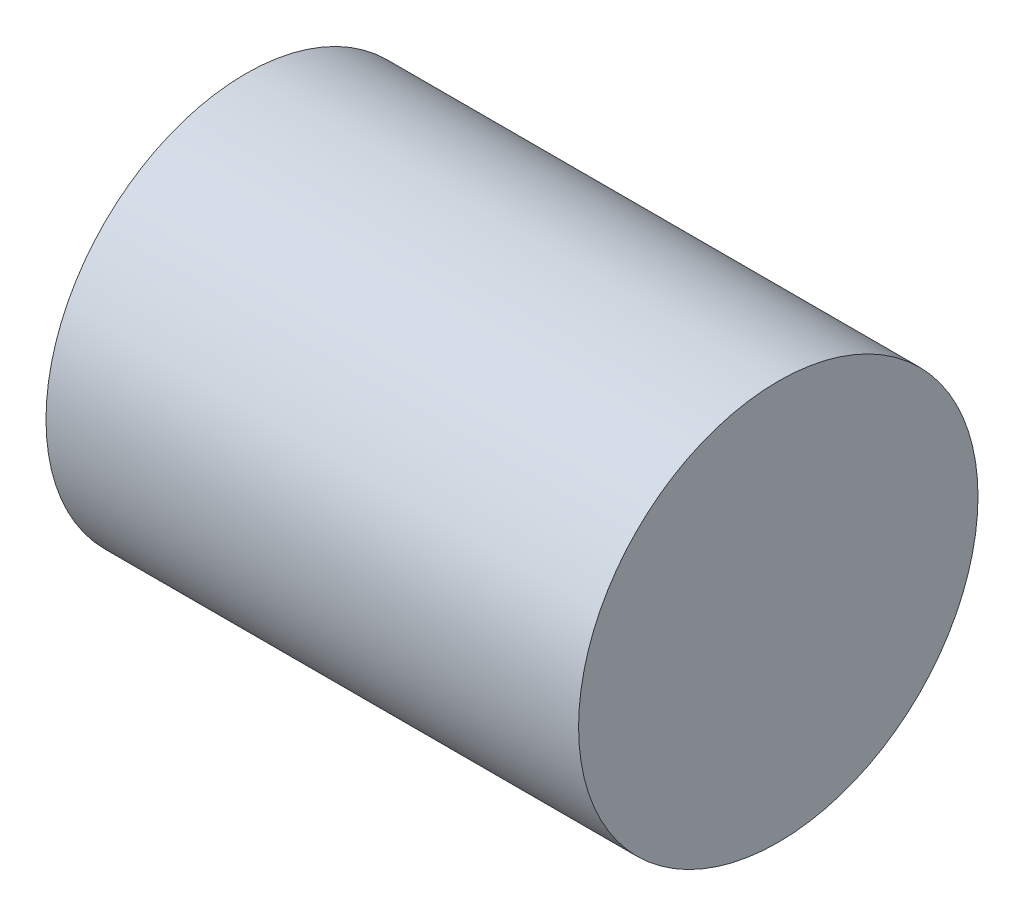
ISO-10303-21;
HEADER;
FILE_DESCRIPTION(('STEP AP214'),'2;1');
FILE_NAME('part.step','',(''),(''),'','','');
FILE_SCHEMA(('AUTOMOTIVE_DESIGN { 1 0 10303 214 1 1 1 1 }'));
ENDSEC;
DATA;
#1=APPLICATION_CONTEXT('core data for automotive mechanical design processes');
#2=APPLICATION_PROTOCOL_DEFINITION('international standard','automotive_design',2000,#1);
#3=PRODUCT_CONTEXT('',#1,'mechanical');
#4=PRODUCT('Part','Part','',(#3));
#5=PRODUCT_RELATED_PRODUCT_CATEGORY('part','',(#4));
#6=PRODUCT_DEFINITION_FORMATION('','',#4);
#7=PRODUCT_DEFINITION_CONTEXT('part definition',#1,'design');
#8=PRODUCT_DEFINITION('design','',#6,#7);
#9=PRODUCT_DEFINITION_SHAPE('','',#8);
#10=(LENGTH_UNIT() NAMED_UNIT(*) SI_UNIT(.MILLI.,.METRE.));
#11=(NAMED_UNIT(*) PLANE_ANGLE_UNIT() SI_UNIT($,.RADIAN.));
#12=(NAMED_UNIT(*) SI_UNIT($,.STERADIAN.) SOLID_ANGLE_UNIT());
#13=UNCERTAINTY_MEASURE_WITH_UNIT(LENGTH_MEASURE(1.E-05),#10,'distance_accuracy_value','');
#14=(GEOMETRIC_REPRESENTATION_CONTEXT(3) GLOBAL_UNCERTAINTY_ASSIGNED_CONTEXT((#13)) GLOBAL_UNIT_ASSIGNED_CONTEXT((#10,
#11,#12)) REPRESENTATION_CONTEXT('',''));
#15=CARTESIAN_POINT('',(0.,0.,0.));
#16=DIRECTION('',(0.,0.,1.));
#17=DIRECTION('',(1.,0.,0.));
#18=AXIS2_PLACEMENT_3D('',#15,#16,#17);
#19=CARTESIAN_POINT('',(-40.,0.,0.));
#20=DIRECTION('',(1.,0.,0.));
#21=DIRECTION('',(0.,0.,-1.));
#22=AXIS2_PLACEMENT_3D('',#19,#20,#21);
#23=CYLINDRICAL_SURFACE('',#22,15.);
#24=CARTESIAN_POINT('',(-40.,0.,0.));
#25=DIRECTION('',(1.,0.,0.));
#26=DIRECTION('',(0.,0.,-1.));
#27=AXIS2_PLACEMENT_3D('',#24,#25,#26);
#28=CIRCLE('',#27,15.);
#29=CARTESIAN_POINT('',(-40.,0.,-15.));
#30=VERTEX_POINT('',#29);
#31=EDGE_CURVE('E10',#30,#30,#28,.T.);
#32=ORIENTED_EDGE('',*,*,#31,.T.);
#33=EDGE_LOOP('',(#32));
#34=FACE_BOUND('',#33,.T.);
#35=CARTESIAN_POINT('',(0.,0.,0.));
#36=DIRECTION('',(1.,0.,0.));
#37=DIRECTION('',(0.,0.,-1.));
#38=AXIS2_PLACEMENT_3D('',#35,#36,#37);
#39=CIRCLE('',#38,15.);
#40=CARTESIAN_POINT('',(0.,0.,-15.));
#41=VERTEX_POINT('',#40);
#42=EDGE_CURVE('E35',#41,#41,#39,.T.);
#43=ORIENTED_EDGE('',*,*,#42,.F.);
#44=EDGE_LOOP('',(#43));
#45=FACE_BOUND('',#44,.T.);
#46=ADVANCED_FACE('F32',(#34,#45),#23,.T.);
#47=CARTESIAN_POINT('',(-40.,0.,0.));
#48=DIRECTION('',(1.,0.,0.));
#49=DIRECTION('',(0.,0.,-1.));
#50=AXIS2_PLACEMENT_3D('',#47,#48,#49);
#51=PLANE('',#50);
#52=ORIENTED_EDGE('',*,*,#31,.F.);
#53=EDGE_LOOP('',(#52));
#54=FACE_BOUND('',#53,.T.);
#55=ADVANCED_FACE('F47',(#54),#51,.F.);
#56=CARTESIAN_POINT('',(0.,0.,0.));
#57=DIRECTION('',(1.,0.,0.));
#58=DIRECTION('',(0.,0.,-1.));
#59=AXIS2_PLACEMENT_3D('',#56,#57,#58);
#60=PLANE('',#59);
#61=ORIENTED_EDGE('',*,*,#42,.T.);
#62=EDGE_LOOP('',(#61));
#63=FACE_BOUND('',#62,.T.);
#64=ADVANCED_FACE('F44',(#63),#60,.T.);
#65=CLOSED_SHELL('',(#46,#55,#64));
#66=MANIFOLD_SOLID_BREP('B2',#65);
#67=ADVANCED_BREP_SHAPE_REPRESENTATION('',(#18,#66),#14);
#68=SHAPE_DEFINITION_REPRESENTATION(#9,#67);
ENDSEC;
END-ISO-10303-21;
